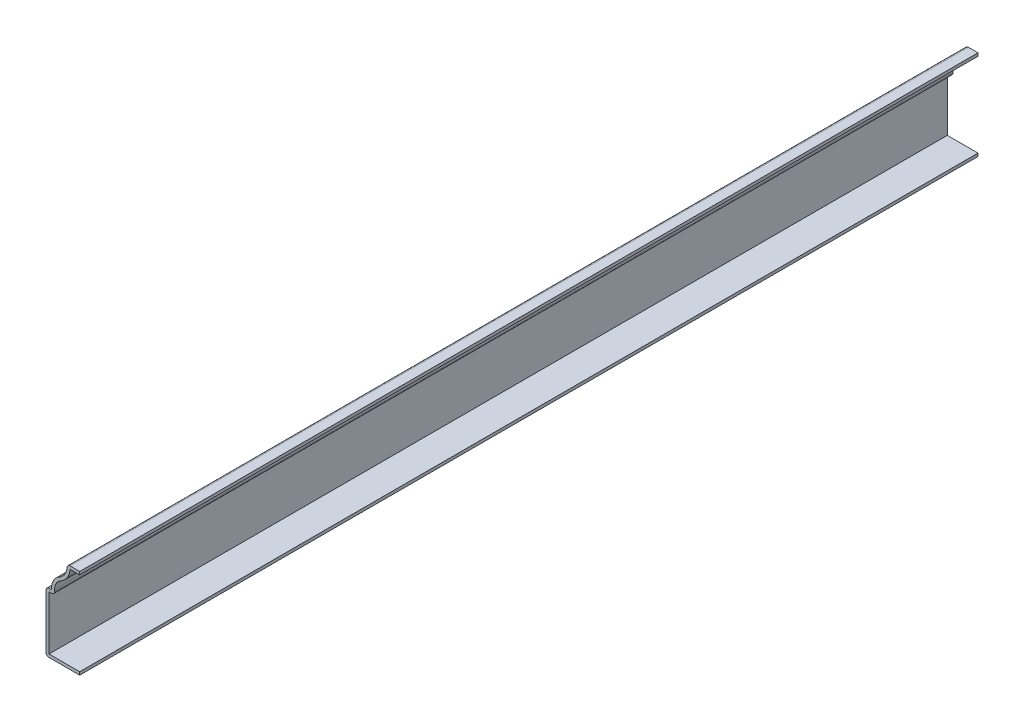
ISO-10303-21;
HEADER;
FILE_DESCRIPTION(('STEP AP214'),'2;1');
FILE_NAME('part.step','',(''),(''),'','','');
FILE_SCHEMA(('AUTOMOTIVE_DESIGN { 1 0 10303 214 1 1 1 1 }'));
ENDSEC;
DATA;
#1=APPLICATION_CONTEXT('core data for automotive mechanical design processes');
#2=APPLICATION_PROTOCOL_DEFINITION('international standard','automotive_design',2000,#1);
#3=PRODUCT_CONTEXT('',#1,'mechanical');
#4=PRODUCT('Part','Part','',(#3));
#5=PRODUCT_RELATED_PRODUCT_CATEGORY('part','',(#4));
#6=PRODUCT_DEFINITION_FORMATION('','',#4);
#7=PRODUCT_DEFINITION_CONTEXT('part definition',#1,'design');
#8=PRODUCT_DEFINITION('design','',#6,#7);
#9=PRODUCT_DEFINITION_SHAPE('','',#8);
#10=(LENGTH_UNIT() NAMED_UNIT(*) SI_UNIT(.MILLI.,.METRE.));
#11=(NAMED_UNIT(*) PLANE_ANGLE_UNIT() SI_UNIT($,.RADIAN.));
#12=(NAMED_UNIT(*) SI_UNIT($,.STERADIAN.) SOLID_ANGLE_UNIT());
#13=UNCERTAINTY_MEASURE_WITH_UNIT(LENGTH_MEASURE(1.E-05),#10,'distance_accuracy_value','');
#14=(GEOMETRIC_REPRESENTATION_CONTEXT(3) GLOBAL_UNCERTAINTY_ASSIGNED_CONTEXT((#13)) GLOBAL_UNIT_ASSIGNED_CONTEXT((#10,
#11,#12)) REPRESENTATION_CONTEXT('',''));
#15=CARTESIAN_POINT('',(0.,0.,0.));
#16=DIRECTION('',(0.,0.,1.));
#17=DIRECTION('',(1.,0.,0.));
#18=AXIS2_PLACEMENT_3D('',#15,#16,#17);
#19=CARTESIAN_POINT('',(0.,0.762,-381.));
#20=DIRECTION('',(-1.,0.,0.));
#21=DIRECTION('',(0.,-1.,0.));
#22=AXIS2_PLACEMENT_3D('',#19,#20,#21);
#23=PLANE('',#22);
#24=DIRECTION('',(0.,-1.,0.));
#25=VECTOR('',#24,1.);
#26=CARTESIAN_POINT('',(0.,0.762,0.));
#27=LINE('',#26,#25);
#28=CARTESIAN_POINT('',(0.,1.27,0.));
#29=VERTEX_POINT('',#28);
#30=CARTESIAN_POINT('',(0.,0.,0.));
#31=VERTEX_POINT('',#30);
#32=EDGE_CURVE('E261',#29,#31,#27,.T.);
#33=ORIENTED_EDGE('',*,*,#32,.T.);
#34=DIRECTION('',(0.,0.,1.));
#35=VECTOR('',#34,1.);
#36=CARTESIAN_POINT('',(0.,0.,-381.));
#37=LINE('',#36,#35);
#38=CARTESIAN_POINT('',(0.,0.,-381.));
#39=VERTEX_POINT('',#38);
#40=EDGE_CURVE('E298',#39,#31,#37,.T.);
#41=ORIENTED_EDGE('',*,*,#40,.F.);
#42=DIRECTION('',(0.,-1.,0.));
#43=VECTOR('',#42,1.);
#44=CARTESIAN_POINT('',(0.,0.762,-381.));
#45=LINE('',#44,#43);
#46=CARTESIAN_POINT('',(0.,1.27,-381.));
#47=VERTEX_POINT('',#46);
#48=EDGE_CURVE('E277',#47,#39,#45,.T.);
#49=ORIENTED_EDGE('',*,*,#48,.F.);
#50=DIRECTION('',(0.,0.,1.));
#51=VECTOR('',#50,1.);
#52=CARTESIAN_POINT('',(0.,1.27,-381.));
#53=LINE('',#52,#51);
#54=EDGE_CURVE('E248',#47,#29,#53,.T.);
#55=ORIENTED_EDGE('',*,*,#54,.T.);
#56=EDGE_LOOP('',(#33,#41,#49,#55));
#57=FACE_BOUND('',#56,.T.);
#58=ADVANCED_FACE('F39',(#57),#23,.F.);
#59=CARTESIAN_POINT('',(0.,0.,-381.));
#60=DIRECTION('',(0.,1.,0.));
#61=DIRECTION('',(-1.,0.,0.));
#62=AXIS2_PLACEMENT_3D('',#59,#60,#61);
#63=PLANE('',#62);
#64=DIRECTION('',(-1.,0.,0.));
#65=VECTOR('',#64,1.);
#66=CARTESIAN_POINT('',(0.,0.,0.));
#67=LINE('',#66,#65);
#68=CARTESIAN_POINT('',(-13.0175,0.,0.));
#69=VERTEX_POINT('',#68);
#70=EDGE_CURVE('E294',#31,#69,#67,.T.);
#71=ORIENTED_EDGE('',*,*,#70,.T.);
#72=DIRECTION('',(0.,0.,1.));
#73=VECTOR('',#72,1.);
#74=CARTESIAN_POINT('',(-13.0175,0.,-381.));
#75=LINE('',#74,#73);
#76=CARTESIAN_POINT('',(-13.0175,0.,-381.));
#77=VERTEX_POINT('',#76);
#78=EDGE_CURVE('E323',#69,#77,#75,.F.);
#79=ORIENTED_EDGE('',*,*,#78,.T.);
#80=DIRECTION('',(-1.,0.,0.));
#81=VECTOR('',#80,1.);
#82=CARTESIAN_POINT('',(0.,0.,-381.));
#83=LINE('',#82,#81);
#84=EDGE_CURVE('E274',#39,#77,#83,.T.);
#85=ORIENTED_EDGE('',*,*,#84,.F.);
#86=ORIENTED_EDGE('',*,*,#40,.T.);
#87=EDGE_LOOP('',(#71,#79,#85,#86));
#88=FACE_BOUND('',#87,.T.);
#89=ADVANCED_FACE('F406',(#88),#63,.F.);
#90=CARTESIAN_POINT('',(-14.2875,0.,-381.));
#91=DIRECTION('',(1.,0.,0.));
#92=DIRECTION('',(0.,0.,-1.));
#93=AXIS2_PLACEMENT_3D('',#90,#91,#92);
#94=PLANE('',#93);
#95=DIRECTION('',(0.,1.,0.));
#96=VECTOR('',#95,1.);
#97=CARTESIAN_POINT('',(-14.2875,0.,-381.));
#98=LINE('',#97,#96);
#99=CARTESIAN_POINT('',(-14.2875,1.27,-381.));
#100=VERTEX_POINT('',#99);
#101=CARTESIAN_POINT('',(-14.2875,24.13,-381.));
#102=VERTEX_POINT('',#101);
#103=EDGE_CURVE('E271',#100,#102,#98,.T.);
#104=ORIENTED_EDGE('',*,*,#103,.F.);
#105=DIRECTION('',(0.,0.,1.));
#106=VECTOR('',#105,1.);
#107=CARTESIAN_POINT('',(-14.2875,1.27,-381.));
#108=LINE('',#107,#106);
#109=CARTESIAN_POINT('',(-14.2875,1.27,0.));
#110=VERTEX_POINT('',#109);
#111=EDGE_CURVE('E314',#100,#110,#108,.T.);
#112=ORIENTED_EDGE('',*,*,#111,.T.);
#113=DIRECTION('',(0.,1.,0.));
#114=VECTOR('',#113,1.);
#115=CARTESIAN_POINT('',(-14.2875,0.,0.));
#116=LINE('',#115,#114);
#117=CARTESIAN_POINT('',(-14.2875,24.13,0.));
#118=VERTEX_POINT('',#117);
#119=EDGE_CURVE('E291',#110,#118,#116,.T.);
#120=ORIENTED_EDGE('',*,*,#119,.T.);
#121=DIRECTION('',(0.,0.,1.));
#122=VECTOR('',#121,1.);
#123=CARTESIAN_POINT('',(-14.2875,24.13,-381.));
#124=LINE('',#123,#122);
#125=EDGE_CURVE('E301',#118,#102,#124,.F.);
#126=ORIENTED_EDGE('',*,*,#125,.T.);
#127=EDGE_LOOP('',(#104,#112,#120,#126));
#128=FACE_BOUND('',#127,.T.);
#129=ADVANCED_FACE('F378',(#128),#94,.F.);
#130=CARTESIAN_POINT('',(-14.2875,25.4,-381.));
#131=DIRECTION('',(0.,-1.,0.));
#132=DIRECTION('',(1.,0.,0.));
#133=AXIS2_PLACEMENT_3D('',#130,#131,#132);
#134=PLANE('',#133);
#135=DIRECTION('',(1.,0.,0.));
#136=VECTOR('',#135,1.);
#137=CARTESIAN_POINT('',(-14.2875,25.4,-381.));
#138=LINE('',#137,#136);
#139=CARTESIAN_POINT('',(-13.0175,25.4,-381.));
#140=VERTEX_POINT('',#139);
#141=CARTESIAN_POINT('',(-11.90625,25.4,-381.));
#142=VERTEX_POINT('',#141);
#143=EDGE_CURVE('E269',#140,#142,#138,.T.);
#144=ORIENTED_EDGE('',*,*,#143,.F.);
#145=DIRECTION('',(0.,0.,1.));
#146=VECTOR('',#145,1.);
#147=CARTESIAN_POINT('',(-13.0175,25.4,-381.));
#148=LINE('',#147,#146);
#149=CARTESIAN_POINT('',(-13.0175,25.4,0.));
#150=VERTEX_POINT('',#149);
#151=EDGE_CURVE('E330',#140,#150,#148,.T.);
#152=ORIENTED_EDGE('',*,*,#151,.T.);
#153=DIRECTION('',(1.,0.,0.));
#154=VECTOR('',#153,1.);
#155=CARTESIAN_POINT('',(-14.2875,25.4,0.));
#156=LINE('',#155,#154);
#157=CARTESIAN_POINT('',(-11.90625,25.4,0.));
#158=VERTEX_POINT('',#157);
#159=EDGE_CURVE('E289',#150,#158,#156,.T.);
#160=ORIENTED_EDGE('',*,*,#159,.T.);
#161=DIRECTION('',(0.,0.,1.));
#162=VECTOR('',#161,1.);
#163=CARTESIAN_POINT('',(-11.90625,25.4,-381.));
#164=LINE('',#163,#162);
#165=EDGE_CURVE('E302',#142,#158,#164,.T.);
#166=ORIENTED_EDGE('',*,*,#165,.F.);
#167=EDGE_LOOP('',(#144,#152,#160,#166));
#168=FACE_BOUND('',#167,.T.);
#169=ADVANCED_FACE('F389',(#168),#134,.F.);
#170=CARTESIAN_POINT('',(-11.90625,25.4,-381.));
#171=DIRECTION('',(1.,0.,0.));
#172=DIRECTION('',(0.,0.,-1.));
#173=AXIS2_PLACEMENT_3D('',#170,#171,#172);
#174=PLANE('',#173);
#175=DIRECTION('',(0.,1.,0.));
#176=VECTOR('',#175,1.);
#177=CARTESIAN_POINT('',(-11.90625,25.4,0.));
#178=LINE('',#177,#176);
#179=CARTESIAN_POINT('',(-11.90625,26.19375,0.));
#180=VERTEX_POINT('',#179);
#181=EDGE_CURVE('E287',#158,#180,#178,.T.);
#182=ORIENTED_EDGE('',*,*,#181,.T.);
#183=DIRECTION('',(0.,0.,1.));
#184=VECTOR('',#183,1.);
#185=CARTESIAN_POINT('',(-11.90625,26.19375,-381.));
#186=LINE('',#185,#184);
#187=CARTESIAN_POINT('',(-11.90625,26.19375,-381.));
#188=VERTEX_POINT('',#187);
#189=EDGE_CURVE('E305',#188,#180,#186,.T.);
#190=ORIENTED_EDGE('',*,*,#189,.F.);
#191=DIRECTION('',(0.,1.,0.));
#192=VECTOR('',#191,1.);
#193=CARTESIAN_POINT('',(-11.90625,25.4,-381.));
#194=LINE('',#193,#192);
#195=EDGE_CURVE('E267',#142,#188,#194,.T.);
#196=ORIENTED_EDGE('',*,*,#195,.F.);
#197=ORIENTED_EDGE('',*,*,#165,.T.);
#198=EDGE_LOOP('',(#182,#190,#196,#197));
#199=FACE_BOUND('',#198,.T.);
#200=ADVANCED_FACE('F396',(#199),#174,.F.);
#201=CARTESIAN_POINT('',(-5.55625,26.19375,-381.));
#202=DIRECTION('',(0.,0.,1.));
#203=DIRECTION('',(1.,0.,0.));
#204=AXIS2_PLACEMENT_3D('',#201,#202,#203);
#205=CYLINDRICAL_SURFACE('',#204,6.35);
#206=CARTESIAN_POINT('',(-5.55625,26.19375,0.));
#207=DIRECTION('',(0.,0.,-1.));
#208=DIRECTION('',(-1.,0.,0.));
#209=AXIS2_PLACEMENT_3D('',#206,#207,#208);
#210=CIRCLE('',#209,6.35);
#211=CARTESIAN_POINT('',(-8.63043053105214,31.75,0.));
#212=VERTEX_POINT('',#211);
#213=EDGE_CURVE('E285',#180,#212,#210,.T.);
#214=ORIENTED_EDGE('',*,*,#213,.T.);
#215=DIRECTION('',(0.,0.,1.));
#216=VECTOR('',#215,1.);
#217=CARTESIAN_POINT('',(-8.63043053105214,31.75,-381.));
#218=LINE('',#217,#216);
#219=CARTESIAN_POINT('',(-8.63043053105214,31.75,-381.));
#220=VERTEX_POINT('',#219);
#221=EDGE_CURVE('E308',#220,#212,#218,.T.);
#222=ORIENTED_EDGE('',*,*,#221,.F.);
#223=CARTESIAN_POINT('',(-5.55625,26.19375,-381.));
#224=DIRECTION('',(0.,0.,-1.));
#225=DIRECTION('',(-1.,0.,0.));
#226=AXIS2_PLACEMENT_3D('',#223,#224,#225);
#227=CIRCLE('',#226,6.35);
#228=EDGE_CURVE('E265',#188,#220,#227,.T.);
#229=ORIENTED_EDGE('',*,*,#228,.F.);
#230=ORIENTED_EDGE('',*,*,#189,.T.);
#231=EDGE_LOOP('',(#214,#222,#229,#230));
#232=FACE_BOUND('',#231,.T.);
#233=ADVANCED_FACE('F399',(#232),#205,.T.);
#234=CARTESIAN_POINT('',(-11.7046110621043,37.30625,-381.));
#235=DIRECTION('',(0.,0.,1.));
#236=DIRECTION('',(1.,0.,0.));
#237=AXIS2_PLACEMENT_3D('',#234,#235,#236);
#238=CYLINDRICAL_SURFACE('',#237,6.35);
#239=CARTESIAN_POINT('',(-11.7046110621043,37.30625,0.));
#240=DIRECTION('',(0.,0.,1.));
#241=DIRECTION('',(1.,0.,0.));
#242=AXIS2_PLACEMENT_3D('',#239,#240,#241);
#243=CIRCLE('',#242,6.35);
#244=CARTESIAN_POINT('',(-5.3670255412316,36.909375,0.));
#245=VERTEX_POINT('',#244);
#246=EDGE_CURVE('E283',#212,#245,#243,.T.);
#247=ORIENTED_EDGE('',*,*,#246,.T.);
#248=DIRECTION('',(0.,0.,1.));
#249=VECTOR('',#248,1.);
#250=CARTESIAN_POINT('',(-5.3670255412316,36.909375,-381.));
#251=LINE('',#250,#249);
#252=CARTESIAN_POINT('',(-5.3670255412316,36.909375,-381.));
#253=VERTEX_POINT('',#252);
#254=EDGE_CURVE('E11',#245,#253,#251,.F.);
#255=ORIENTED_EDGE('',*,*,#254,.T.);
#256=CARTESIAN_POINT('',(-11.7046110621043,37.30625,-381.));
#257=DIRECTION('',(0.,0.,1.));
#258=DIRECTION('',(1.,0.,0.));
#259=AXIS2_PLACEMENT_3D('',#256,#257,#258);
#260=CIRCLE('',#259,6.35);
#261=EDGE_CURVE('E263',#220,#253,#260,.T.);
#262=ORIENTED_EDGE('',*,*,#261,.F.);
#263=ORIENTED_EDGE('',*,*,#221,.T.);
#264=EDGE_LOOP('',(#247,#255,#262,#263));
#265=FACE_BOUND('',#264,.T.);
#266=ADVANCED_FACE('F400',(#265),#238,.F.);
#267=CARTESIAN_POINT('',(-5.35461106210427,38.1,-381.));
#268=DIRECTION('',(0.,-1.,0.));
#269=DIRECTION('',(0.,0.,-1.));
#270=AXIS2_PLACEMENT_3D('',#267,#268,#269);
#271=PLANE('',#270);
#272=DIRECTION('',(1.,0.,0.));
#273=VECTOR('',#272,1.);
#274=CARTESIAN_POINT('',(-5.35461106210427,38.1,-381.));
#275=LINE('',#274,#273);
#276=CARTESIAN_POINT('',(-4.09950843705706,38.1,-381.));
#277=VERTEX_POINT('',#276);
#278=CARTESIAN_POINT('',(0.,38.1,-381.));
#279=VERTEX_POINT('',#278);
#280=EDGE_CURVE('E260',#277,#279,#275,.T.);
#281=ORIENTED_EDGE('',*,*,#280,.F.);
#282=DIRECTION('',(0.,0.,1.));
#283=VECTOR('',#282,1.);
#284=CARTESIAN_POINT('',(-4.09950843705706,38.1,-381.));
#285=LINE('',#284,#283);
#286=CARTESIAN_POINT('',(-4.09950843705706,38.1,0.));
#287=VERTEX_POINT('',#286);
#288=EDGE_CURVE('E47',#277,#287,#285,.T.);
#289=ORIENTED_EDGE('',*,*,#288,.T.);
#290=DIRECTION('',(1.,0.,0.));
#291=VECTOR('',#290,1.);
#292=CARTESIAN_POINT('',(-5.35461106210427,38.1,0.));
#293=LINE('',#292,#291);
#294=CARTESIAN_POINT('',(0.,38.1,0.));
#295=VERTEX_POINT('',#294);
#296=EDGE_CURVE('E281',#287,#295,#293,.T.);
#297=ORIENTED_EDGE('',*,*,#296,.T.);
#298=DIRECTION('',(0.,0.,1.));
#299=VECTOR('',#298,1.);
#300=CARTESIAN_POINT('',(0.,38.1,-381.));
#301=LINE('',#300,#299);
#302=EDGE_CURVE('E279',#279,#295,#301,.T.);
#303=ORIENTED_EDGE('',*,*,#302,.F.);
#304=EDGE_LOOP('',(#281,#289,#297,#303));
#305=FACE_BOUND('',#304,.T.);
#306=ADVANCED_FACE('F336',(#305),#271,.F.);
#307=CARTESIAN_POINT('',(0.,38.1,-381.));
#308=DIRECTION('',(-1.,0.,0.));
#309=DIRECTION('',(0.,0.,1.));
#310=AXIS2_PLACEMENT_3D('',#307,#308,#309);
#311=PLANE('',#310);
#312=DIRECTION('',(0.,0.,-1.));
#313=VECTOR('',#312,1.);
#314=CARTESIAN_POINT('',(0.,36.83,-381.));
#315=LINE('',#314,#313);
#316=CARTESIAN_POINT('',(0.,36.83,-381.));
#317=VERTEX_POINT('',#316);
#318=CARTESIAN_POINT('',(0.,36.83,0.));
#319=VERTEX_POINT('',#318);
#320=EDGE_CURVE('E184',#317,#319,#315,.F.);
#321=ORIENTED_EDGE('',*,*,#320,.F.);
#322=DIRECTION('',(0.,-1.,0.));
#323=VECTOR('',#322,1.);
#324=CARTESIAN_POINT('',(0.,38.1,-381.));
#325=LINE('',#324,#323);
#326=EDGE_CURVE('E258',#279,#317,#325,.T.);
#327=ORIENTED_EDGE('',*,*,#326,.F.);
#328=ORIENTED_EDGE('',*,*,#302,.T.);
#329=DIRECTION('',(0.,-1.,0.));
#330=VECTOR('',#329,1.);
#331=CARTESIAN_POINT('',(0.,38.1,0.));
#332=LINE('',#331,#330);
#333=EDGE_CURVE('E254',#295,#319,#332,.T.);
#334=ORIENTED_EDGE('',*,*,#333,.T.);
#335=EDGE_LOOP('',(#321,#327,#328,#334));
#336=FACE_BOUND('',#335,.T.);
#337=ADVANCED_FACE('F341',(#336),#311,.F.);
#338=CARTESIAN_POINT('',(-11.7046110621043,37.30625,-381.));
#339=DIRECTION('',(0.,0.,1.));
#340=DIRECTION('',(1.,0.,0.));
#341=AXIS2_PLACEMENT_3D('',#338,#339,#340);
#342=PLANE('',#341);
#343=ORIENTED_EDGE('',*,*,#84,.T.);
#344=CARTESIAN_POINT('',(-13.0175,1.27,-381.));
#345=DIRECTION('',(0.,0.,1.));
#346=DIRECTION('',(1.,0.,0.));
#347=AXIS2_PLACEMENT_3D('',#344,#345,#346);
#348=CIRCLE('',#347,1.27);
#349=EDGE_CURVE('E328',#77,#100,#348,.F.);
#350=ORIENTED_EDGE('',*,*,#349,.T.);
#351=ORIENTED_EDGE('',*,*,#103,.T.);
#352=CARTESIAN_POINT('',(-13.0175,24.13,-381.));
#353=DIRECTION('',(0.,0.,1.));
#354=DIRECTION('',(1.,0.,0.));
#355=AXIS2_PLACEMENT_3D('',#352,#353,#354);
#356=CIRCLE('',#355,1.27);
#357=EDGE_CURVE('E326',#102,#140,#356,.F.);
#358=ORIENTED_EDGE('',*,*,#357,.T.);
#359=ORIENTED_EDGE('',*,*,#143,.T.);
#360=ORIENTED_EDGE('',*,*,#195,.T.);
#361=ORIENTED_EDGE('',*,*,#228,.T.);
#362=ORIENTED_EDGE('',*,*,#261,.T.);
#363=CARTESIAN_POINT('',(-4.09950843705706,36.83,-381.));
#364=DIRECTION('',(0.,0.,1.));
#365=DIRECTION('',(1.,0.,0.));
#366=AXIS2_PLACEMENT_3D('',#363,#364,#365);
#367=CIRCLE('',#366,1.27);
#368=EDGE_CURVE('E54',#253,#277,#367,.F.);
#369=ORIENTED_EDGE('',*,*,#368,.T.);
#370=ORIENTED_EDGE('',*,*,#280,.T.);
#371=ORIENTED_EDGE('',*,*,#326,.T.);
#372=DIRECTION('',(1.,0.,0.));
#373=VECTOR('',#372,1.);
#374=CARTESIAN_POINT('',(-5.35461106210427,36.83,-381.));
#375=LINE('',#374,#373);
#376=CARTESIAN_POINT('',(-4.09950843705706,36.83,-381.));
#377=VERTEX_POINT('',#376);
#378=EDGE_CURVE('E255',#377,#317,#375,.T.);
#379=ORIENTED_EDGE('',*,*,#378,.F.);
#380=CARTESIAN_POINT('',(-11.7046110621043,37.30625,-381.));
#381=DIRECTION('',(0.,0.,1.));
#382=DIRECTION('',(1.,0.,0.));
#383=AXIS2_PLACEMENT_3D('',#380,#381,#382);
#384=CIRCLE('',#383,7.62);
#385=CARTESIAN_POINT('',(-8.01559442484171,30.63875,-381.));
#386=VERTEX_POINT('',#385);
#387=EDGE_CURVE('E201',#386,#377,#384,.T.);
#388=ORIENTED_EDGE('',*,*,#387,.F.);
#389=CARTESIAN_POINT('',(-5.55625,26.19375,-381.));
#390=DIRECTION('',(0.,0.,1.));
#391=DIRECTION('',(1.,0.,0.));
#392=AXIS2_PLACEMENT_3D('',#389,#390,#391);
#393=CIRCLE('',#392,5.08);
#394=CARTESIAN_POINT('',(-10.63625,26.19375,-381.));
#395=VERTEX_POINT('',#394);
#396=EDGE_CURVE('E211',#395,#386,#393,.F.);
#397=ORIENTED_EDGE('',*,*,#396,.F.);
#398=DIRECTION('',(0.,1.,0.));
#399=VECTOR('',#398,1.);
#400=CARTESIAN_POINT('',(-10.63625,25.4,-381.));
#401=LINE('',#400,#399);
#402=CARTESIAN_POINT('',(-10.63625,25.4,-381.));
#403=VERTEX_POINT('',#402);
#404=EDGE_CURVE('E218',#403,#395,#401,.T.);
#405=ORIENTED_EDGE('',*,*,#404,.F.);
#406=CARTESIAN_POINT('',(-11.90625,25.4,-381.));
#407=DIRECTION('',(0.,0.,1.));
#408=DIRECTION('',(1.,0.,0.));
#409=AXIS2_PLACEMENT_3D('',#406,#407,#408);
#410=CIRCLE('',#409,1.27);
#411=CARTESIAN_POINT('',(-11.90625,24.13,-381.));
#412=VERTEX_POINT('',#411);
#413=EDGE_CURVE('E220',#403,#412,#410,.F.);
#414=ORIENTED_EDGE('',*,*,#413,.T.);
#415=DIRECTION('',(1.,0.,0.));
#416=VECTOR('',#415,1.);
#417=CARTESIAN_POINT('',(-14.2875,24.13,-381.));
#418=LINE('',#417,#416);
#419=CARTESIAN_POINT('',(-13.0175,24.13,-381.));
#420=VERTEX_POINT('',#419);
#421=EDGE_CURVE('E229',#420,#412,#418,.T.);
#422=ORIENTED_EDGE('',*,*,#421,.F.);
#423=DIRECTION('',(0.,1.,0.));
#424=VECTOR('',#423,1.);
#425=CARTESIAN_POINT('',(-13.0175,0.,-381.));
#426=LINE('',#425,#424);
#427=CARTESIAN_POINT('',(-13.0175,1.27,-381.));
#428=VERTEX_POINT('',#427);
#429=EDGE_CURVE('E243',#428,#420,#426,.T.);
#430=ORIENTED_EDGE('',*,*,#429,.F.);
#431=DIRECTION('',(-1.,0.,0.));
#432=VECTOR('',#431,1.);
#433=CARTESIAN_POINT('',(0.,1.27,-381.));
#434=LINE('',#433,#432);
#435=EDGE_CURVE('E251',#47,#428,#434,.T.);
#436=ORIENTED_EDGE('',*,*,#435,.F.);
#437=ORIENTED_EDGE('',*,*,#48,.T.);
#438=EDGE_LOOP('',(#343,#350,#351,#358,#359,#360,#361,#362,#369,#370,#371,#379,#388,#397,#405,
#414,#422,#430,#436,#437));
#439=FACE_BOUND('',#438,.T.);
#440=ADVANCED_FACE('F343',(#439),#342,.F.);
#441=CARTESIAN_POINT('',(-11.7046110621043,37.30625,0.));
#442=DIRECTION('',(0.,0.,1.));
#443=DIRECTION('',(1.,0.,0.));
#444=AXIS2_PLACEMENT_3D('',#441,#442,#443);
#445=PLANE('',#444);
#446=ORIENTED_EDGE('',*,*,#119,.F.);
#447=CARTESIAN_POINT('',(-13.0175,1.27,0.));
#448=DIRECTION('',(0.,0.,1.));
#449=DIRECTION('',(1.,0.,0.));
#450=AXIS2_PLACEMENT_3D('',#447,#448,#449);
#451=CIRCLE('',#450,1.27);
#452=EDGE_CURVE('E321',#110,#69,#451,.T.);
#453=ORIENTED_EDGE('',*,*,#452,.T.);
#454=ORIENTED_EDGE('',*,*,#70,.F.);
#455=ORIENTED_EDGE('',*,*,#32,.F.);
#456=DIRECTION('',(-1.,0.,0.));
#457=VECTOR('',#456,1.);
#458=CARTESIAN_POINT('',(0.,1.27,0.));
#459=LINE('',#458,#457);
#460=CARTESIAN_POINT('',(-13.0175,1.27,0.));
#461=VERTEX_POINT('',#460);
#462=EDGE_CURVE('E245',#29,#461,#459,.T.);
#463=ORIENTED_EDGE('',*,*,#462,.T.);
#464=DIRECTION('',(0.,1.,0.));
#465=VECTOR('',#464,1.);
#466=CARTESIAN_POINT('',(-13.0175,0.,0.));
#467=LINE('',#466,#465);
#468=CARTESIAN_POINT('',(-13.0175,24.13,0.));
#469=VERTEX_POINT('',#468);
#470=EDGE_CURVE('E237',#461,#469,#467,.T.);
#471=ORIENTED_EDGE('',*,*,#470,.T.);
#472=DIRECTION('',(1.,0.,0.));
#473=VECTOR('',#472,1.);
#474=CARTESIAN_POINT('',(-14.2875,24.13,0.));
#475=LINE('',#474,#473);
#476=CARTESIAN_POINT('',(-11.90625,24.13,0.));
#477=VERTEX_POINT('',#476);
#478=EDGE_CURVE('E231',#469,#477,#475,.T.);
#479=ORIENTED_EDGE('',*,*,#478,.T.);
#480=CARTESIAN_POINT('',(-11.90625,25.4,0.));
#481=DIRECTION('',(0.,0.,1.));
#482=DIRECTION('',(1.,0.,0.));
#483=AXIS2_PLACEMENT_3D('',#480,#481,#482);
#484=CIRCLE('',#483,1.27);
#485=CARTESIAN_POINT('',(-10.63625,25.4,0.));
#486=VERTEX_POINT('',#485);
#487=EDGE_CURVE('E223',#477,#486,#484,.T.);
#488=ORIENTED_EDGE('',*,*,#487,.T.);
#489=DIRECTION('',(0.,1.,0.));
#490=VECTOR('',#489,1.);
#491=CARTESIAN_POINT('',(-10.63625,25.4,0.));
#492=LINE('',#491,#490);
#493=CARTESIAN_POINT('',(-10.63625,26.19375,0.));
#494=VERTEX_POINT('',#493);
#495=EDGE_CURVE('E213',#486,#494,#492,.T.);
#496=ORIENTED_EDGE('',*,*,#495,.T.);
#497=CARTESIAN_POINT('',(-5.55625,26.19375,0.));
#498=DIRECTION('',(0.,0.,1.));
#499=DIRECTION('',(1.,0.,0.));
#500=AXIS2_PLACEMENT_3D('',#497,#498,#499);
#501=CIRCLE('',#500,5.08);
#502=CARTESIAN_POINT('',(-8.01559442484171,30.63875,0.));
#503=VERTEX_POINT('',#502);
#504=EDGE_CURVE('E193',#494,#503,#501,.F.);
#505=ORIENTED_EDGE('',*,*,#504,.T.);
#506=CARTESIAN_POINT('',(-11.7046110621043,37.30625,0.));
#507=DIRECTION('',(0.,0.,1.));
#508=DIRECTION('',(1.,0.,0.));
#509=AXIS2_PLACEMENT_3D('',#506,#507,#508);
#510=CIRCLE('',#509,7.62);
#511=CARTESIAN_POINT('',(-4.09950843705706,36.83,0.));
#512=VERTEX_POINT('',#511);
#513=EDGE_CURVE('E189',#503,#512,#510,.T.);
#514=ORIENTED_EDGE('',*,*,#513,.T.);
#515=DIRECTION('',(1.,0.,0.));
#516=VECTOR('',#515,1.);
#517=CARTESIAN_POINT('',(-5.35461106210427,36.83,0.));
#518=LINE('',#517,#516);
#519=EDGE_CURVE('E177',#512,#319,#518,.T.);
#520=ORIENTED_EDGE('',*,*,#519,.T.);
#521=ORIENTED_EDGE('',*,*,#333,.F.);
#522=ORIENTED_EDGE('',*,*,#296,.F.);
#523=CARTESIAN_POINT('',(-4.09950843705706,36.83,0.));
#524=DIRECTION('',(0.,0.,1.));
#525=DIRECTION('',(1.,0.,0.));
#526=AXIS2_PLACEMENT_3D('',#523,#524,#525);
#527=CIRCLE('',#526,1.27);
#528=EDGE_CURVE('E317',#287,#245,#527,.T.);
#529=ORIENTED_EDGE('',*,*,#528,.T.);
#530=ORIENTED_EDGE('',*,*,#246,.F.);
#531=ORIENTED_EDGE('',*,*,#213,.F.);
#532=ORIENTED_EDGE('',*,*,#181,.F.);
#533=ORIENTED_EDGE('',*,*,#159,.F.);
#534=CARTESIAN_POINT('',(-13.0175,24.13,0.));
#535=DIRECTION('',(0.,0.,1.));
#536=DIRECTION('',(1.,0.,0.));
#537=AXIS2_PLACEMENT_3D('',#534,#535,#536);
#538=CIRCLE('',#537,1.27);
#539=EDGE_CURVE('E319',#150,#118,#538,.T.);
#540=ORIENTED_EDGE('',*,*,#539,.T.);
#541=EDGE_LOOP('',(#446,#453,#454,#455,#463,#471,#479,#488,#496,#505,#514,#520,#521,#522,#529,
#530,#531,#532,#533,#540));
#542=FACE_BOUND('',#541,.T.);
#543=ADVANCED_FACE('F191',(#542),#445,.T.);
#544=CARTESIAN_POINT('',(0.,1.27,-381.));
#545=DIRECTION('',(0.,1.,0.));
#546=DIRECTION('',(-1.,0.,0.));
#547=AXIS2_PLACEMENT_3D('',#544,#545,#546);
#548=PLANE('',#547);
#549=ORIENTED_EDGE('',*,*,#462,.F.);
#550=ORIENTED_EDGE('',*,*,#54,.F.);
#551=ORIENTED_EDGE('',*,*,#435,.T.);
#552=DIRECTION('',(0.,0.,1.));
#553=VECTOR('',#552,1.);
#554=CARTESIAN_POINT('',(-13.0175,1.27,-381.));
#555=LINE('',#554,#553);
#556=EDGE_CURVE('E240',#428,#461,#555,.T.);
#557=ORIENTED_EDGE('',*,*,#556,.T.);
#558=EDGE_LOOP('',(#549,#550,#551,#557));
#559=FACE_BOUND('',#558,.T.);
#560=ADVANCED_FACE('F366',(#559),#548,.T.);
#561=CARTESIAN_POINT('',(-13.0175,0.,-381.));
#562=DIRECTION('',(1.,0.,0.));
#563=DIRECTION('',(0.,0.,-1.));
#564=AXIS2_PLACEMENT_3D('',#561,#562,#563);
#565=PLANE('',#564);
#566=ORIENTED_EDGE('',*,*,#470,.F.);
#567=ORIENTED_EDGE('',*,*,#556,.F.);
#568=ORIENTED_EDGE('',*,*,#429,.T.);
#569=DIRECTION('',(0.,0.,1.));
#570=VECTOR('',#569,1.);
#571=CARTESIAN_POINT('',(-13.0175,24.13,-381.));
#572=LINE('',#571,#570);
#573=EDGE_CURVE('E234',#420,#469,#572,.T.);
#574=ORIENTED_EDGE('',*,*,#573,.T.);
#575=EDGE_LOOP('',(#566,#567,#568,#574));
#576=FACE_BOUND('',#575,.T.);
#577=ADVANCED_FACE('F360',(#576),#565,.T.);
#578=CARTESIAN_POINT('',(-14.2875,24.13,-381.));
#579=DIRECTION('',(0.,-1.,0.));
#580=DIRECTION('',(1.,0.,0.));
#581=AXIS2_PLACEMENT_3D('',#578,#579,#580);
#582=PLANE('',#581);
#583=ORIENTED_EDGE('',*,*,#421,.T.);
#584=DIRECTION('',(0.,0.,1.));
#585=VECTOR('',#584,1.);
#586=CARTESIAN_POINT('',(-11.90625,24.13,-381.));
#587=LINE('',#586,#585);
#588=EDGE_CURVE('E226',#412,#477,#587,.T.);
#589=ORIENTED_EDGE('',*,*,#588,.T.);
#590=ORIENTED_EDGE('',*,*,#478,.F.);
#591=ORIENTED_EDGE('',*,*,#573,.F.);
#592=EDGE_LOOP('',(#583,#589,#590,#591));
#593=FACE_BOUND('',#592,.T.);
#594=ADVANCED_FACE('F358',(#593),#582,.T.);
#595=CARTESIAN_POINT('',(-11.90625,25.4,-381.));
#596=DIRECTION('',(0.,0.,1.));
#597=DIRECTION('',(1.,0.,0.));
#598=AXIS2_PLACEMENT_3D('',#595,#596,#597);
#599=CYLINDRICAL_SURFACE('',#598,1.27);
#600=ORIENTED_EDGE('',*,*,#413,.F.);
#601=DIRECTION('',(0.,0.,-1.));
#602=VECTOR('',#601,1.);
#603=CARTESIAN_POINT('',(-10.63625,25.4,-381.));
#604=LINE('',#603,#602);
#605=EDGE_CURVE('E215',#486,#403,#604,.T.);
#606=ORIENTED_EDGE('',*,*,#605,.F.);
#607=ORIENTED_EDGE('',*,*,#487,.F.);
#608=ORIENTED_EDGE('',*,*,#588,.F.);
#609=EDGE_LOOP('',(#600,#606,#607,#608));
#610=FACE_BOUND('',#609,.T.);
#611=ADVANCED_FACE('F356',(#610),#599,.T.);
#612=CARTESIAN_POINT('',(-10.63625,25.4,-381.));
#613=DIRECTION('',(1.,0.,0.));
#614=DIRECTION('',(0.,0.,-1.));
#615=AXIS2_PLACEMENT_3D('',#612,#613,#614);
#616=PLANE('',#615);
#617=ORIENTED_EDGE('',*,*,#495,.F.);
#618=ORIENTED_EDGE('',*,*,#605,.T.);
#619=ORIENTED_EDGE('',*,*,#404,.T.);
#620=DIRECTION('',(0.,0.,-1.));
#621=VECTOR('',#620,1.);
#622=CARTESIAN_POINT('',(-10.63625,26.19375,-381.));
#623=LINE('',#622,#621);
#624=EDGE_CURVE('E208',#395,#494,#623,.F.);
#625=ORIENTED_EDGE('',*,*,#624,.T.);
#626=EDGE_LOOP('',(#617,#618,#619,#625));
#627=FACE_BOUND('',#626,.T.);
#628=ADVANCED_FACE('F350',(#627),#616,.T.);
#629=CARTESIAN_POINT('',(-5.55625,26.19375,-381.));
#630=DIRECTION('',(0.,0.,1.));
#631=DIRECTION('',(1.,0.,0.));
#632=AXIS2_PLACEMENT_3D('',#629,#630,#631);
#633=CYLINDRICAL_SURFACE('',#632,5.08);
#634=ORIENTED_EDGE('',*,*,#504,.F.);
#635=ORIENTED_EDGE('',*,*,#624,.F.);
#636=ORIENTED_EDGE('',*,*,#396,.T.);
#637=DIRECTION('',(0.,0.,1.));
#638=VECTOR('',#637,1.);
#639=CARTESIAN_POINT('',(-8.01559442484171,30.63875,-381.));
#640=LINE('',#639,#638);
#641=EDGE_CURVE('E197',#386,#503,#640,.T.);
#642=ORIENTED_EDGE('',*,*,#641,.T.);
#643=EDGE_LOOP('',(#634,#635,#636,#642));
#644=FACE_BOUND('',#643,.T.);
#645=ADVANCED_FACE('F348',(#644),#633,.F.);
#646=CARTESIAN_POINT('',(-11.7046110621043,37.30625,-381.));
#647=DIRECTION('',(0.,0.,1.));
#648=DIRECTION('',(1.,0.,0.));
#649=AXIS2_PLACEMENT_3D('',#646,#647,#648);
#650=CYLINDRICAL_SURFACE('',#649,7.62);
#651=DIRECTION('',(0.,0.,1.));
#652=VECTOR('',#651,1.);
#653=CARTESIAN_POINT('',(-4.09950843705706,36.83,-381.));
#654=LINE('',#653,#652);
#655=EDGE_CURVE('E182',#512,#377,#654,.F.);
#656=ORIENTED_EDGE('',*,*,#655,.F.);
#657=ORIENTED_EDGE('',*,*,#513,.F.);
#658=ORIENTED_EDGE('',*,*,#641,.F.);
#659=ORIENTED_EDGE('',*,*,#387,.T.);
#660=EDGE_LOOP('',(#656,#657,#658,#659));
#661=FACE_BOUND('',#660,.T.);
#662=ADVANCED_FACE('F199',(#661),#650,.T.);
#663=CARTESIAN_POINT('',(-5.35461106210427,36.83,-381.));
#664=DIRECTION('',(0.,-1.,0.));
#665=DIRECTION('',(0.,0.,-1.));
#666=AXIS2_PLACEMENT_3D('',#663,#664,#665);
#667=PLANE('',#666);
#668=ORIENTED_EDGE('',*,*,#655,.T.);
#669=ORIENTED_EDGE('',*,*,#378,.T.);
#670=ORIENTED_EDGE('',*,*,#320,.T.);
#671=ORIENTED_EDGE('',*,*,#519,.F.);
#672=EDGE_LOOP('',(#668,#669,#670,#671));
#673=FACE_BOUND('',#672,.T.);
#674=ADVANCED_FACE('F179',(#673),#667,.T.);
#675=CARTESIAN_POINT('',(-13.0175,1.27,-381.));
#676=DIRECTION('',(0.,0.,1.));
#677=DIRECTION('',(1.,0.,0.));
#678=AXIS2_PLACEMENT_3D('',#675,#676,#677);
#679=CYLINDRICAL_SURFACE('',#678,1.27);
#680=ORIENTED_EDGE('',*,*,#349,.F.);
#681=ORIENTED_EDGE('',*,*,#78,.F.);
#682=ORIENTED_EDGE('',*,*,#452,.F.);
#683=ORIENTED_EDGE('',*,*,#111,.F.);
#684=EDGE_LOOP('',(#680,#681,#682,#683));
#685=FACE_BOUND('',#684,.T.);
#686=ADVANCED_FACE('F376',(#685),#679,.T.);
#687=CARTESIAN_POINT('',(-13.0175,24.13,-381.));
#688=DIRECTION('',(0.,0.,1.));
#689=DIRECTION('',(1.,0.,0.));
#690=AXIS2_PLACEMENT_3D('',#687,#688,#689);
#691=CYLINDRICAL_SURFACE('',#690,1.27);
#692=ORIENTED_EDGE('',*,*,#357,.F.);
#693=ORIENTED_EDGE('',*,*,#125,.F.);
#694=ORIENTED_EDGE('',*,*,#539,.F.);
#695=ORIENTED_EDGE('',*,*,#151,.F.);
#696=EDGE_LOOP('',(#692,#693,#694,#695));
#697=FACE_BOUND('',#696,.T.);
#698=ADVANCED_FACE('F386',(#697),#691,.T.);
#699=CARTESIAN_POINT('',(-4.09950843705706,36.83,-381.));
#700=DIRECTION('',(0.,0.,1.));
#701=DIRECTION('',(1.,0.,0.));
#702=AXIS2_PLACEMENT_3D('',#699,#700,#701);
#703=CYLINDRICAL_SURFACE('',#702,1.27);
#704=ORIENTED_EDGE('',*,*,#368,.F.);
#705=ORIENTED_EDGE('',*,*,#254,.F.);
#706=ORIENTED_EDGE('',*,*,#528,.F.);
#707=ORIENTED_EDGE('',*,*,#288,.F.);
#708=EDGE_LOOP('',(#704,#705,#706,#707));
#709=FACE_BOUND('',#708,.T.);
#710=ADVANCED_FACE('F41',(#709),#703,.T.);
#711=CLOSED_SHELL('',(#58,#89,#129,#169,#200,#233,#266,#306,#337,#440,#543,#560,#577,#594,#611,
#628,#645,#662,#674,#686,#698,#710));
#712=MANIFOLD_SOLID_BREP('B2',#711);
#713=ADVANCED_BREP_SHAPE_REPRESENTATION('',(#18,#712),#14);
#714=SHAPE_DEFINITION_REPRESENTATION(#9,#713);
ENDSEC;
END-ISO-10303-21;
